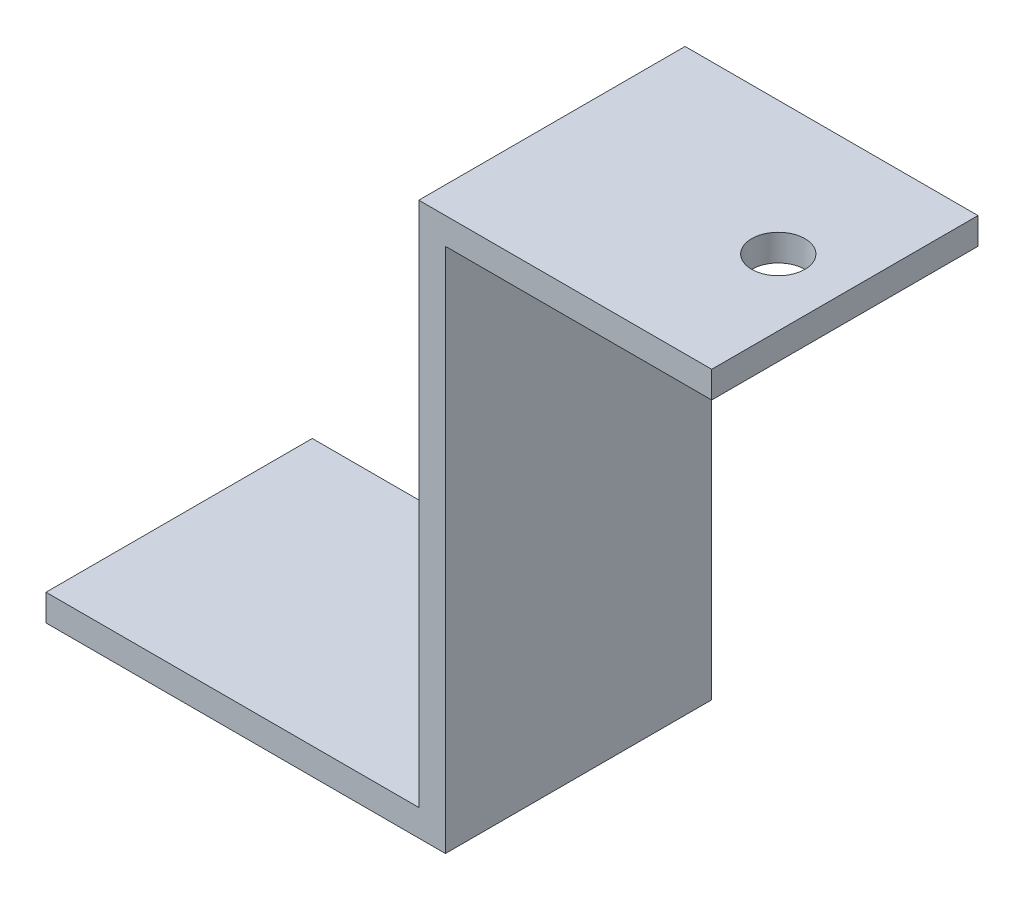
ISO-10303-21;
HEADER;
FILE_DESCRIPTION(('STEP AP214'),'2;1');
FILE_NAME('part.step','',(''),(''),'','','');
FILE_SCHEMA(('AUTOMOTIVE_DESIGN { 1 0 10303 214 1 1 1 1 }'));
ENDSEC;
DATA;
#1=APPLICATION_CONTEXT('core data for automotive mechanical design processes');
#2=APPLICATION_PROTOCOL_DEFINITION('international standard','automotive_design',2000,#1);
#3=PRODUCT_CONTEXT('',#1,'mechanical');
#4=PRODUCT('Part','Part','',(#3));
#5=PRODUCT_RELATED_PRODUCT_CATEGORY('part','',(#4));
#6=PRODUCT_DEFINITION_FORMATION('','',#4);
#7=PRODUCT_DEFINITION_CONTEXT('part definition',#1,'design');
#8=PRODUCT_DEFINITION('design','',#6,#7);
#9=PRODUCT_DEFINITION_SHAPE('','',#8);
#10=(LENGTH_UNIT() NAMED_UNIT(*) SI_UNIT(.MILLI.,.METRE.));
#11=(NAMED_UNIT(*) PLANE_ANGLE_UNIT() SI_UNIT($,.RADIAN.));
#12=(NAMED_UNIT(*) SI_UNIT($,.STERADIAN.) SOLID_ANGLE_UNIT());
#13=UNCERTAINTY_MEASURE_WITH_UNIT(LENGTH_MEASURE(1.E-05),#10,'distance_accuracy_value','');
#14=(GEOMETRIC_REPRESENTATION_CONTEXT(3) GLOBAL_UNCERTAINTY_ASSIGNED_CONTEXT((#13)) GLOBAL_UNIT_ASSIGNED_CONTEXT((#10,
#11,#12)) REPRESENTATION_CONTEXT('',''));
#15=CARTESIAN_POINT('',(0.,0.,0.));
#16=DIRECTION('',(0.,0.,1.));
#17=DIRECTION('',(1.,0.,0.));
#18=AXIS2_PLACEMENT_3D('',#15,#16,#17);
#19=CARTESIAN_POINT('',(-19.1756074084226,-0.639685610563795,20.));
#20=DIRECTION('',(1.,0.,0.));
#21=DIRECTION('',(0.,0.,-1.));
#22=AXIS2_PLACEMENT_3D('',#19,#20,#21);
#23=PLANE('',#22);
#24=DIRECTION('',(0.,-1.,0.));
#25=VECTOR('',#24,1.);
#26=CARTESIAN_POINT('',(-19.1756074084226,-0.639685610563795,0.));
#27=LINE('',#26,#25);
#28=CARTESIAN_POINT('',(-19.1756074084226,38.8603143894362,0.));
#29=VERTEX_POINT('',#28);
#30=CARTESIAN_POINT('',(-19.1756074084226,-0.639685610563795,0.));
#31=VERTEX_POINT('',#30);
#32=EDGE_CURVE('E135',#29,#31,#27,.T.);
#33=ORIENTED_EDGE('',*,*,#32,.T.);
#34=DIRECTION('',(0.,0.,-1.));
#35=VECTOR('',#34,1.);
#36=CARTESIAN_POINT('',(-19.1756074084226,-0.639685610563795,20.));
#37=LINE('',#36,#35);
#38=CARTESIAN_POINT('',(-19.1756074084226,-0.639685610563795,20.));
#39=VERTEX_POINT('',#38);
#40=EDGE_CURVE('E43',#39,#31,#37,.T.);
#41=ORIENTED_EDGE('',*,*,#40,.F.);
#42=DIRECTION('',(0.,-1.,0.));
#43=VECTOR('',#42,1.);
#44=CARTESIAN_POINT('',(-19.1756074084226,-0.639685610563795,20.));
#45=LINE('',#44,#43);
#46=CARTESIAN_POINT('',(-19.1756074084226,38.8603143894362,20.));
#47=VERTEX_POINT('',#46);
#48=EDGE_CURVE('E96',#47,#39,#45,.T.);
#49=ORIENTED_EDGE('',*,*,#48,.F.);
#50=DIRECTION('',(0.,0.,-1.));
#51=VECTOR('',#50,1.);
#52=CARTESIAN_POINT('',(-19.1756074084226,38.8603143894362,20.));
#53=LINE('',#52,#51);
#54=EDGE_CURVE('E11',#47,#29,#53,.T.);
#55=ORIENTED_EDGE('',*,*,#54,.T.);
#56=EDGE_LOOP('',(#33,#41,#49,#55));
#57=FACE_BOUND('',#56,.T.);
#58=ADVANCED_FACE('F35',(#57),#23,.F.);
#59=CARTESIAN_POINT('',(-47.1756074084226,-0.639685610563795,20.));
#60=DIRECTION('',(0.,-1.,0.));
#61=DIRECTION('',(0.,0.,-1.));
#62=AXIS2_PLACEMENT_3D('',#59,#60,#61);
#63=PLANE('',#62);
#64=DIRECTION('',(-1.,0.,0.));
#65=VECTOR('',#64,1.);
#66=CARTESIAN_POINT('',(-47.1756074084226,-0.639685610563795,0.));
#67=LINE('',#66,#65);
#68=CARTESIAN_POINT('',(-47.1756074084226,-0.639685610563795,0.));
#69=VERTEX_POINT('',#68);
#70=EDGE_CURVE('E137',#31,#69,#67,.T.);
#71=ORIENTED_EDGE('',*,*,#70,.T.);
#72=DIRECTION('',(0.,0.,-1.));
#73=VECTOR('',#72,1.);
#74=CARTESIAN_POINT('',(-47.1756074084226,-0.639685610563795,20.));
#75=LINE('',#74,#73);
#76=CARTESIAN_POINT('',(-47.1756074084226,-0.639685610563795,20.));
#77=VERTEX_POINT('',#76);
#78=EDGE_CURVE('E156',#77,#69,#75,.T.);
#79=ORIENTED_EDGE('',*,*,#78,.F.);
#80=DIRECTION('',(-1.,0.,0.));
#81=VECTOR('',#80,1.);
#82=CARTESIAN_POINT('',(-47.1756074084226,-0.639685610563795,20.));
#83=LINE('',#82,#81);
#84=EDGE_CURVE('E164',#39,#77,#83,.T.);
#85=ORIENTED_EDGE('',*,*,#84,.F.);
#86=ORIENTED_EDGE('',*,*,#40,.T.);
#87=EDGE_LOOP('',(#71,#79,#85,#86));
#88=FACE_BOUND('',#87,.T.);
#89=ADVANCED_FACE('F162',(#88),#63,.F.);
#90=CARTESIAN_POINT('',(-47.1756074084226,-2.6396856105638,20.));
#91=DIRECTION('',(1.,0.,0.));
#92=DIRECTION('',(0.,0.,-1.));
#93=AXIS2_PLACEMENT_3D('',#90,#91,#92);
#94=PLANE('',#93);
#95=DIRECTION('',(0.,-1.,0.));
#96=VECTOR('',#95,1.);
#97=CARTESIAN_POINT('',(-47.1756074084226,-2.6396856105638,0.));
#98=LINE('',#97,#96);
#99=CARTESIAN_POINT('',(-47.1756074084226,-2.6396856105638,0.));
#100=VERTEX_POINT('',#99);
#101=EDGE_CURVE('E140',#69,#100,#98,.T.);
#102=ORIENTED_EDGE('',*,*,#101,.T.);
#103=DIRECTION('',(0.,0.,-1.));
#104=VECTOR('',#103,1.);
#105=CARTESIAN_POINT('',(-47.1756074084226,-2.6396856105638,20.));
#106=LINE('',#105,#104);
#107=CARTESIAN_POINT('',(-47.1756074084226,-2.6396856105638,20.));
#108=VERTEX_POINT('',#107);
#109=EDGE_CURVE('E153',#108,#100,#106,.T.);
#110=ORIENTED_EDGE('',*,*,#109,.F.);
#111=DIRECTION('',(0.,-1.,0.));
#112=VECTOR('',#111,1.);
#113=CARTESIAN_POINT('',(-47.1756074084226,-2.6396856105638,20.));
#114=LINE('',#113,#112);
#115=EDGE_CURVE('E174',#77,#108,#114,.T.);
#116=ORIENTED_EDGE('',*,*,#115,.F.);
#117=ORIENTED_EDGE('',*,*,#78,.T.);
#118=EDGE_LOOP('',(#102,#110,#116,#117));
#119=FACE_BOUND('',#118,.T.);
#120=ADVANCED_FACE('F170',(#119),#94,.F.);
#121=CARTESIAN_POINT('',(-17.1756074084226,-2.6396856105638,20.));
#122=DIRECTION('',(0.,1.,0.));
#123=DIRECTION('',(0.,0.,1.));
#124=AXIS2_PLACEMENT_3D('',#121,#122,#123);
#125=PLANE('',#124);
#126=DIRECTION('',(1.,0.,0.));
#127=VECTOR('',#126,1.);
#128=CARTESIAN_POINT('',(-17.1756074084226,-2.6396856105638,0.));
#129=LINE('',#128,#127);
#130=CARTESIAN_POINT('',(-17.1756074084226,-2.6396856105638,0.));
#131=VERTEX_POINT('',#130);
#132=EDGE_CURVE('E142',#100,#131,#129,.T.);
#133=ORIENTED_EDGE('',*,*,#132,.T.);
#134=DIRECTION('',(0.,0.,-1.));
#135=VECTOR('',#134,1.);
#136=CARTESIAN_POINT('',(-17.1756074084226,-2.6396856105638,20.));
#137=LINE('',#136,#135);
#138=CARTESIAN_POINT('',(-17.1756074084226,-2.6396856105638,20.));
#139=VERTEX_POINT('',#138);
#140=EDGE_CURVE('E124',#139,#131,#137,.T.);
#141=ORIENTED_EDGE('',*,*,#140,.F.);
#142=DIRECTION('',(1.,0.,0.));
#143=VECTOR('',#142,1.);
#144=CARTESIAN_POINT('',(-17.1756074084226,-2.6396856105638,20.));
#145=LINE('',#144,#143);
#146=EDGE_CURVE('E116',#108,#139,#145,.T.);
#147=ORIENTED_EDGE('',*,*,#146,.F.);
#148=ORIENTED_EDGE('',*,*,#109,.T.);
#149=EDGE_LOOP('',(#133,#141,#147,#148));
#150=FACE_BOUND('',#149,.T.);
#151=ADVANCED_FACE('F173',(#150),#125,.F.);
#152=CARTESIAN_POINT('',(-17.1756074084226,36.8603143894362,20.));
#153=DIRECTION('',(-1.,0.,0.));
#154=DIRECTION('',(0.,-1.,0.));
#155=AXIS2_PLACEMENT_3D('',#152,#153,#154);
#156=PLANE('',#155);
#157=DIRECTION('',(0.,1.,0.));
#158=VECTOR('',#157,1.);
#159=CARTESIAN_POINT('',(-17.1756074084226,36.8603143894362,0.));
#160=LINE('',#159,#158);
#161=CARTESIAN_POINT('',(-17.1756074084226,36.8603143894362,0.));
#162=VERTEX_POINT('',#161);
#163=EDGE_CURVE('E123',#131,#162,#160,.T.);
#164=ORIENTED_EDGE('',*,*,#163,.T.);
#165=DIRECTION('',(0.,0.,-1.));
#166=VECTOR('',#165,1.);
#167=CARTESIAN_POINT('',(-17.1756074084226,36.8603143894362,20.));
#168=LINE('',#167,#166);
#169=CARTESIAN_POINT('',(-17.1756074084226,36.8603143894362,20.));
#170=VERTEX_POINT('',#169);
#171=EDGE_CURVE('E121',#170,#162,#168,.T.);
#172=ORIENTED_EDGE('',*,*,#171,.F.);
#173=DIRECTION('',(0.,1.,0.));
#174=VECTOR('',#173,1.);
#175=CARTESIAN_POINT('',(-17.1756074084226,-0.639685610563795,20.));
#176=LINE('',#175,#174);
#177=EDGE_CURVE('E110',#139,#170,#176,.T.);
#178=ORIENTED_EDGE('',*,*,#177,.F.);
#179=ORIENTED_EDGE('',*,*,#140,.T.);
#180=EDGE_LOOP('',(#164,#172,#178,#179));
#181=FACE_BOUND('',#180,.T.);
#182=ADVANCED_FACE('F122',(#181),#156,.F.);
#183=CARTESIAN_POINT('',(2.82439259157742,36.8603143894362,20.));
#184=DIRECTION('',(0.,1.,0.));
#185=DIRECTION('',(0.,0.,1.));
#186=AXIS2_PLACEMENT_3D('',#183,#184,#185);
#187=PLANE('',#186);
#188=CARTESIAN_POINT('',(-2.17560740842256,36.8603143894362,10.));
#189=DIRECTION('',(0.,1.,0.));
#190=DIRECTION('',(0.,0.,1.));
#191=AXIS2_PLACEMENT_3D('',#188,#189,#190);
#192=CIRCLE('',#191,2.);
#193=CARTESIAN_POINT('',(-2.17560740842256,36.8603143894362,12.));
#194=VERTEX_POINT('',#193);
#195=EDGE_CURVE('E138',#194,#194,#192,.T.);
#196=ORIENTED_EDGE('',*,*,#195,.T.);
#197=EDGE_LOOP('',(#196));
#198=FACE_BOUND('',#197,.T.);
#199=DIRECTION('',(1.,0.,0.));
#200=VECTOR('',#199,1.);
#201=CARTESIAN_POINT('',(2.82439259157742,36.8603143894362,0.));
#202=LINE('',#201,#200);
#203=CARTESIAN_POINT('',(2.82439259157742,36.8603143894362,0.));
#204=VERTEX_POINT('',#203);
#205=EDGE_CURVE('E81',#162,#204,#202,.T.);
#206=ORIENTED_EDGE('',*,*,#205,.T.);
#207=DIRECTION('',(0.,0.,-1.));
#208=VECTOR('',#207,1.);
#209=CARTESIAN_POINT('',(2.82439259157742,36.8603143894362,20.));
#210=LINE('',#209,#208);
#211=CARTESIAN_POINT('',(2.82439259157742,36.8603143894362,20.));
#212=VERTEX_POINT('',#211);
#213=EDGE_CURVE('E125',#212,#204,#210,.T.);
#214=ORIENTED_EDGE('',*,*,#213,.F.);
#215=DIRECTION('',(1.,0.,0.));
#216=VECTOR('',#215,1.);
#217=CARTESIAN_POINT('',(2.82439259157742,36.8603143894362,20.));
#218=LINE('',#217,#216);
#219=EDGE_CURVE('E114',#170,#212,#218,.T.);
#220=ORIENTED_EDGE('',*,*,#219,.F.);
#221=ORIENTED_EDGE('',*,*,#171,.T.);
#222=EDGE_LOOP('',(#206,#214,#220,#221));
#223=FACE_BOUND('',#222,.T.);
#224=ADVANCED_FACE('F127',(#198,#223),#187,.F.);
#225=CARTESIAN_POINT('',(2.82439259157742,38.8603143894362,20.));
#226=DIRECTION('',(-1.,0.,0.));
#227=DIRECTION('',(0.,-1.,0.));
#228=AXIS2_PLACEMENT_3D('',#225,#226,#227);
#229=PLANE('',#228);
#230=DIRECTION('',(0.,1.,0.));
#231=VECTOR('',#230,1.);
#232=CARTESIAN_POINT('',(2.82439259157742,38.8603143894362,0.));
#233=LINE('',#232,#231);
#234=CARTESIAN_POINT('',(2.82439259157742,38.8603143894362,0.));
#235=VERTEX_POINT('',#234);
#236=EDGE_CURVE('E147',#204,#235,#233,.T.);
#237=ORIENTED_EDGE('',*,*,#236,.T.);
#238=DIRECTION('',(0.,0.,-1.));
#239=VECTOR('',#238,1.);
#240=CARTESIAN_POINT('',(2.82439259157742,38.8603143894362,20.));
#241=LINE('',#240,#239);
#242=CARTESIAN_POINT('',(2.82439259157742,38.8603143894362,20.));
#243=VERTEX_POINT('',#242);
#244=EDGE_CURVE('E131',#243,#235,#241,.T.);
#245=ORIENTED_EDGE('',*,*,#244,.F.);
#246=DIRECTION('',(0.,1.,0.));
#247=VECTOR('',#246,1.);
#248=CARTESIAN_POINT('',(2.82439259157742,38.8603143894362,20.));
#249=LINE('',#248,#247);
#250=EDGE_CURVE('E129',#212,#243,#249,.T.);
#251=ORIENTED_EDGE('',*,*,#250,.F.);
#252=ORIENTED_EDGE('',*,*,#213,.T.);
#253=EDGE_LOOP('',(#237,#245,#251,#252));
#254=FACE_BOUND('',#253,.T.);
#255=ADVANCED_FACE('F191',(#254),#229,.F.);
#256=CARTESIAN_POINT('',(-17.1756074084226,38.8603143894362,20.));
#257=DIRECTION('',(0.,-1.,0.));
#258=DIRECTION('',(1.,0.,0.));
#259=AXIS2_PLACEMENT_3D('',#256,#257,#258);
#260=PLANE('',#259);
#261=CARTESIAN_POINT('',(-2.17560740842256,38.8603143894362,10.));
#262=DIRECTION('',(0.,1.,0.));
#263=DIRECTION('',(0.,0.,1.));
#264=AXIS2_PLACEMENT_3D('',#261,#262,#263);
#265=CIRCLE('',#264,2.);
#266=CARTESIAN_POINT('',(-2.17560740842256,38.8603143894362,12.));
#267=VERTEX_POINT('',#266);
#268=EDGE_CURVE('E182',#267,#267,#265,.T.);
#269=ORIENTED_EDGE('',*,*,#268,.F.);
#270=EDGE_LOOP('',(#269));
#271=FACE_BOUND('',#270,.T.);
#272=DIRECTION('',(-1.,0.,0.));
#273=VECTOR('',#272,1.);
#274=CARTESIAN_POINT('',(-17.1756074084226,38.8603143894362,0.));
#275=LINE('',#274,#273);
#276=EDGE_CURVE('E88',#235,#29,#275,.T.);
#277=ORIENTED_EDGE('',*,*,#276,.T.);
#278=ORIENTED_EDGE('',*,*,#54,.F.);
#279=DIRECTION('',(-1.,0.,0.));
#280=VECTOR('',#279,1.);
#281=CARTESIAN_POINT('',(-19.1756074084226,38.8603143894362,20.));
#282=LINE('',#281,#280);
#283=EDGE_CURVE('E51',#243,#47,#282,.T.);
#284=ORIENTED_EDGE('',*,*,#283,.F.);
#285=ORIENTED_EDGE('',*,*,#244,.T.);
#286=EDGE_LOOP('',(#277,#278,#284,#285));
#287=FACE_BOUND('',#286,.T.);
#288=ADVANCED_FACE('F189',(#271,#287),#260,.F.);
#289=CARTESIAN_POINT('',(0.,0.,20.));
#290=DIRECTION('',(0.,0.,-1.));
#291=DIRECTION('',(-1.,0.,0.));
#292=AXIS2_PLACEMENT_3D('',#289,#290,#291);
#293=PLANE('',#292);
#294=ORIENTED_EDGE('',*,*,#283,.T.);
#295=ORIENTED_EDGE('',*,*,#48,.T.);
#296=ORIENTED_EDGE('',*,*,#84,.T.);
#297=ORIENTED_EDGE('',*,*,#115,.T.);
#298=ORIENTED_EDGE('',*,*,#146,.T.);
#299=ORIENTED_EDGE('',*,*,#177,.T.);
#300=ORIENTED_EDGE('',*,*,#219,.T.);
#301=ORIENTED_EDGE('',*,*,#250,.T.);
#302=EDGE_LOOP('',(#294,#295,#296,#297,#298,#299,#300,#301));
#303=FACE_BOUND('',#302,.T.);
#304=ADVANCED_FACE('F112',(#303),#293,.F.);
#305=CARTESIAN_POINT('',(0.,0.,0.));
#306=DIRECTION('',(0.,0.,-1.));
#307=DIRECTION('',(-1.,0.,0.));
#308=AXIS2_PLACEMENT_3D('',#305,#306,#307);
#309=PLANE('',#308);
#310=ORIENTED_EDGE('',*,*,#32,.F.);
#311=ORIENTED_EDGE('',*,*,#276,.F.);
#312=ORIENTED_EDGE('',*,*,#236,.F.);
#313=ORIENTED_EDGE('',*,*,#205,.F.);
#314=ORIENTED_EDGE('',*,*,#163,.F.);
#315=ORIENTED_EDGE('',*,*,#132,.F.);
#316=ORIENTED_EDGE('',*,*,#101,.F.);
#317=ORIENTED_EDGE('',*,*,#70,.F.);
#318=EDGE_LOOP('',(#310,#311,#312,#313,#314,#315,#316,#317));
#319=FACE_BOUND('',#318,.T.);
#320=ADVANCED_FACE('F166',(#319),#309,.T.);
#321=CARTESIAN_POINT('',(-2.17560740842256,18.8603143894362,10.));
#322=DIRECTION('',(0.,1.,0.));
#323=DIRECTION('',(0.,0.,1.));
#324=AXIS2_PLACEMENT_3D('',#321,#322,#323);
#325=CYLINDRICAL_SURFACE('',#324,2.);
#326=ORIENTED_EDGE('',*,*,#268,.T.);
#327=EDGE_LOOP('',(#326));
#328=FACE_BOUND('',#327,.T.);
#329=ORIENTED_EDGE('',*,*,#195,.F.);
#330=EDGE_LOOP('',(#329));
#331=FACE_BOUND('',#330,.T.);
#332=ADVANCED_FACE('F186',(#328,#331),#325,.F.);
#333=CLOSED_SHELL('',(#58,#89,#120,#151,#182,#224,#255,#288,#304,#320,#332));
#334=MANIFOLD_SOLID_BREP('B2',#333);
#335=ADVANCED_BREP_SHAPE_REPRESENTATION('',(#18,#334),#14);
#336=SHAPE_DEFINITION_REPRESENTATION(#9,#335);
ENDSEC;
END-ISO-10303-21;
